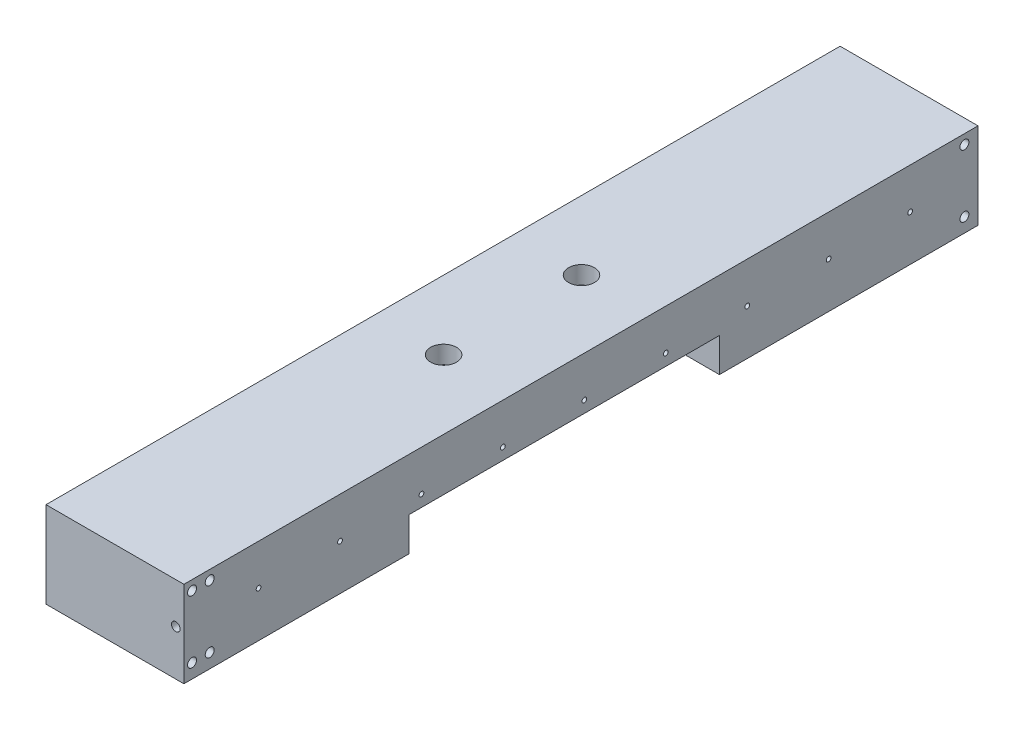
ISO-10303-21;
HEADER;
FILE_DESCRIPTION(('STEP AP214'),'2;1');
FILE_NAME('part.step','',(''),(''),'','','');
FILE_SCHEMA(('AUTOMOTIVE_DESIGN { 1 0 10303 214 1 1 1 1 }'));
ENDSEC;
DATA;
#1=APPLICATION_CONTEXT('core data for automotive mechanical design processes');
#2=APPLICATION_PROTOCOL_DEFINITION('international standard','automotive_design',2000,#1);
#3=PRODUCT_CONTEXT('',#1,'mechanical');
#4=PRODUCT('Part','Part','',(#3));
#5=PRODUCT_RELATED_PRODUCT_CATEGORY('part','',(#4));
#6=PRODUCT_DEFINITION_FORMATION('','',#4);
#7=PRODUCT_DEFINITION_CONTEXT('part definition',#1,'design');
#8=PRODUCT_DEFINITION('design','',#6,#7);
#9=PRODUCT_DEFINITION_SHAPE('','',#8);
#10=(LENGTH_UNIT() NAMED_UNIT(*) SI_UNIT(.MILLI.,.METRE.));
#11=(NAMED_UNIT(*) PLANE_ANGLE_UNIT() SI_UNIT($,.RADIAN.));
#12=(NAMED_UNIT(*) SI_UNIT($,.STERADIAN.) SOLID_ANGLE_UNIT());
#13=UNCERTAINTY_MEASURE_WITH_UNIT(LENGTH_MEASURE(1.E-05),#10,'distance_accuracy_value','');
#14=(GEOMETRIC_REPRESENTATION_CONTEXT(3) GLOBAL_UNCERTAINTY_ASSIGNED_CONTEXT((#13)) GLOBAL_UNIT_ASSIGNED_CONTEXT((#10,
#11,#12)) REPRESENTATION_CONTEXT('',''));
#15=CARTESIAN_POINT('',(0.,0.,0.));
#16=DIRECTION('',(0.,0.,1.));
#17=DIRECTION('',(1.,0.,0.));
#18=AXIS2_PLACEMENT_3D('',#15,#16,#17);
#19=CARTESIAN_POINT('',(50.8000000000003,63.5,241.300000000004));
#20=DIRECTION('',(0.,-1.,0.));
#21=DIRECTION('',(0.,0.,-1.));
#22=AXIS2_PLACEMENT_3D('',#19,#20,#21);
#23=CYLINDRICAL_SURFACE('',#22,4.93435191606192);
#24=CARTESIAN_POINT('',(50.8000000000003,24.9999999999998,241.300000000004));
#25=DIRECTION('',(0.,-1.,0.));
#26=DIRECTION('',(0.,0.,-1.));
#27=AXIS2_PLACEMENT_3D('',#24,#25,#26);
#28=CIRCLE('',#27,4.93435191606192);
#29=CARTESIAN_POINT('',(50.8000000000003,24.9999999999998,236.365648083942));
#30=VERTEX_POINT('',#29);
#31=EDGE_CURVE('E165',#30,#30,#28,.T.);
#32=ORIENTED_EDGE('',*,*,#31,.T.);
#33=EDGE_LOOP('',(#32));
#34=FACE_BOUND('',#33,.T.);
#35=CARTESIAN_POINT('',(50.8000000000003,50.4,241.300000000004));
#36=DIRECTION('',(0.,1.,0.));
#37=DIRECTION('',(0.,0.,1.));
#38=AXIS2_PLACEMENT_3D('',#35,#36,#37);
#39=CIRCLE('',#38,4.93435191606192);
#40=CARTESIAN_POINT('',(50.8000000000003,50.4,246.234351916066));
#41=VERTEX_POINT('',#40);
#42=EDGE_CURVE('E39',#41,#41,#39,.F.);
#43=ORIENTED_EDGE('',*,*,#42,.F.);
#44=EDGE_LOOP('',(#43));
#45=FACE_BOUND('',#44,.T.);
#46=ADVANCED_FACE('F35',(#34,#45),#23,.F.);
#47=CARTESIAN_POINT('',(50.8000000000003,63.5,342.900000000004));
#48=DIRECTION('',(0.,-1.,0.));
#49=DIRECTION('',(0.,0.,-1.));
#50=AXIS2_PLACEMENT_3D('',#47,#48,#49);
#51=CYLINDRICAL_SURFACE('',#50,4.93435191606192);
#52=CARTESIAN_POINT('',(50.8000000000003,24.9999999999998,342.900000000004));
#53=DIRECTION('',(0.,-1.,0.));
#54=DIRECTION('',(0.,0.,-1.));
#55=AXIS2_PLACEMENT_3D('',#52,#53,#54);
#56=CIRCLE('',#55,4.93435191606192);
#57=CARTESIAN_POINT('',(50.8000000000003,24.9999999999998,337.965648083942));
#58=VERTEX_POINT('',#57);
#59=EDGE_CURVE('E174',#58,#58,#56,.T.);
#60=ORIENTED_EDGE('',*,*,#59,.T.);
#61=EDGE_LOOP('',(#60));
#62=FACE_BOUND('',#61,.T.);
#63=CARTESIAN_POINT('',(50.8000000000003,50.4,342.900000000004));
#64=DIRECTION('',(0.,1.,0.));
#65=DIRECTION('',(0.,0.,1.));
#66=AXIS2_PLACEMENT_3D('',#63,#64,#65);
#67=CIRCLE('',#66,4.93435191606192);
#68=CARTESIAN_POINT('',(50.8000000000003,50.4,347.834351916066));
#69=VERTEX_POINT('',#68);
#70=EDGE_CURVE('E135',#69,#69,#67,.F.);
#71=ORIENTED_EDGE('',*,*,#70,.F.);
#72=EDGE_LOOP('',(#71));
#73=FACE_BOUND('',#72,.T.);
#74=ADVANCED_FACE('F330',(#62,#73),#51,.F.);
#75=CARTESIAN_POINT('',(0.,0.,585.0001));
#76=DIRECTION('',(0.,1.,0.));
#77=DIRECTION('',(0.,0.,1.));
#78=AXIS2_PLACEMENT_3D('',#75,#76,#77);
#79=PLANE('',#78);
#80=DIRECTION('',(0.,0.,-1.));
#81=VECTOR('',#80,1.);
#82=CARTESIAN_POINT('',(101.6,0.,585.0001));
#83=LINE('',#82,#81);
#84=CARTESIAN_POINT('',(101.6,0.,190.5));
#85=VERTEX_POINT('',#84);
#86=CARTESIAN_POINT('',(101.6,0.,0.));
#87=VERTEX_POINT('',#86);
#88=EDGE_CURVE('E130',#85,#87,#83,.T.);
#89=ORIENTED_EDGE('',*,*,#88,.F.);
#90=DIRECTION('',(-1.,0.,0.));
#91=VECTOR('',#90,1.);
#92=CARTESIAN_POINT('',(101.6,0.,190.5));
#93=LINE('',#92,#91);
#94=CARTESIAN_POINT('',(0.,0.,190.5));
#95=VERTEX_POINT('',#94);
#96=EDGE_CURVE('E278',#85,#95,#93,.T.);
#97=ORIENTED_EDGE('',*,*,#96,.T.);
#98=DIRECTION('',(0.,0.,-1.));
#99=VECTOR('',#98,1.);
#100=CARTESIAN_POINT('',(0.,0.,585.0001));
#101=LINE('',#100,#99);
#102=CARTESIAN_POINT('',(0.,0.,0.));
#103=VERTEX_POINT('',#102);
#104=EDGE_CURVE('E44',#95,#103,#101,.T.);
#105=ORIENTED_EDGE('',*,*,#104,.T.);
#106=DIRECTION('',(1.,0.,0.));
#107=VECTOR('',#106,1.);
#108=CARTESIAN_POINT('',(0.,0.,0.));
#109=LINE('',#108,#107);
#110=EDGE_CURVE('E293',#103,#87,#109,.T.);
#111=ORIENTED_EDGE('',*,*,#110,.T.);
#112=EDGE_LOOP('',(#89,#97,#105,#111));
#113=FACE_BOUND('',#112,.T.);
#114=ADVANCED_FACE('F311',(#113),#79,.F.);
#115=CARTESIAN_POINT('',(0.,0.,585.0001));
#116=DIRECTION('',(1.,0.,0.));
#117=DIRECTION('',(0.,0.,-1.));
#118=AXIS2_PLACEMENT_3D('',#115,#116,#117);
#119=PLANE('',#118);
#120=CARTESIAN_POINT('',(0.,41.2873800000004,528.383982869842));
#121=DIRECTION('',(-1.,0.,0.));
#122=DIRECTION('',(0.,0.,1.));
#123=AXIS2_PLACEMENT_3D('',#120,#121,#122);
#124=CIRCLE('',#123,3.17499999999999);
#125=CARTESIAN_POINT('',(0.,41.2873800000004,531.558982869842));
#126=VERTEX_POINT('',#125);
#127=EDGE_CURVE('E166',#126,#126,#124,.T.);
#128=ORIENTED_EDGE('',*,*,#127,.F.);
#129=EDGE_LOOP('',(#128));
#130=FACE_BOUND('',#129,.T.);
#131=CARTESIAN_POINT('',(0.,41.2873800000004,50.8022026598416));
#132=DIRECTION('',(-1.,0.,0.));
#133=DIRECTION('',(0.,0.,1.));
#134=AXIS2_PLACEMENT_3D('',#131,#132,#133);
#135=CIRCLE('',#134,3.17499999999999);
#136=CARTESIAN_POINT('',(0.,41.2873800000004,53.9772026598416));
#137=VERTEX_POINT('',#136);
#138=EDGE_CURVE('E159',#137,#137,#135,.T.);
#139=ORIENTED_EDGE('',*,*,#138,.F.);
#140=EDGE_LOOP('',(#139));
#141=FACE_BOUND('',#140,.T.);
#142=ORIENTED_EDGE('',*,*,#104,.F.);
#143=DIRECTION('',(0.,-1.,0.));
#144=VECTOR('',#143,1.);
#145=CARTESIAN_POINT('',(0.,0.,190.5));
#146=LINE('',#145,#144);
#147=CARTESIAN_POINT('',(0.,24.9999999999998,190.5));
#148=VERTEX_POINT('',#147);
#149=EDGE_CURVE('E119',#148,#95,#146,.T.);
#150=ORIENTED_EDGE('',*,*,#149,.F.);
#151=DIRECTION('',(0.,0.,-1.));
#152=VECTOR('',#151,1.);
#153=CARTESIAN_POINT('',(0.,24.9999999999998,190.5));
#154=LINE('',#153,#152);
#155=CARTESIAN_POINT('',(0.,24.9999999999998,419.1));
#156=VERTEX_POINT('',#155);
#157=EDGE_CURVE('E274',#156,#148,#154,.T.);
#158=ORIENTED_EDGE('',*,*,#157,.F.);
#159=DIRECTION('',(0.,1.,0.));
#160=VECTOR('',#159,1.);
#161=CARTESIAN_POINT('',(0.,24.9999999999998,419.1));
#162=LINE('',#161,#160);
#163=CARTESIAN_POINT('',(0.,0.,419.1));
#164=VERTEX_POINT('',#163);
#165=EDGE_CURVE('E219',#164,#156,#162,.T.);
#166=ORIENTED_EDGE('',*,*,#165,.F.);
#167=CARTESIAN_POINT('',(0.,0.,585.0001));
#168=VERTEX_POINT('',#167);
#169=EDGE_CURVE('E11',#168,#164,#101,.T.);
#170=ORIENTED_EDGE('',*,*,#169,.F.);
#171=DIRECTION('',(0.,-1.,0.));
#172=VECTOR('',#171,1.);
#173=CARTESIAN_POINT('',(0.,0.,585.0001));
#174=LINE('',#173,#172);
#175=CARTESIAN_POINT('',(0.,63.5,585.0001));
#176=VERTEX_POINT('',#175);
#177=EDGE_CURVE('E285',#176,#168,#174,.T.);
#178=ORIENTED_EDGE('',*,*,#177,.F.);
#179=DIRECTION('',(0.,0.,-1.));
#180=VECTOR('',#179,1.);
#181=CARTESIAN_POINT('',(0.,63.5,585.0001));
#182=LINE('',#181,#180);
#183=CARTESIAN_POINT('',(0.,63.5,0.));
#184=VERTEX_POINT('',#183);
#185=EDGE_CURVE('E290',#176,#184,#182,.T.);
#186=ORIENTED_EDGE('',*,*,#185,.T.);
#187=DIRECTION('',(0.,-1.,0.));
#188=VECTOR('',#187,1.);
#189=CARTESIAN_POINT('',(0.,0.,0.));
#190=LINE('',#189,#188);
#191=EDGE_CURVE('E281',#184,#103,#190,.T.);
#192=ORIENTED_EDGE('',*,*,#191,.T.);
#193=EDGE_LOOP('',(#142,#150,#158,#166,#170,#178,#186,#192));
#194=FACE_BOUND('',#193,.T.);
#195=ADVANCED_FACE('F37',(#130,#141,#194),#119,.F.);
#196=ORIENTED_EDGE('',*,*,#169,.T.);
#197=DIRECTION('',(-1.,0.,0.));
#198=VECTOR('',#197,1.);
#199=CARTESIAN_POINT('',(101.6,0.,419.1));
#200=LINE('',#199,#198);
#201=CARTESIAN_POINT('',(101.6,0.,419.1));
#202=VERTEX_POINT('',#201);
#203=EDGE_CURVE('E114',#202,#164,#200,.T.);
#204=ORIENTED_EDGE('',*,*,#203,.F.);
#205=CARTESIAN_POINT('',(101.6,0.,585.0001));
#206=VERTEX_POINT('',#205);
#207=EDGE_CURVE('E122',#206,#202,#83,.T.);
#208=ORIENTED_EDGE('',*,*,#207,.F.);
#209=DIRECTION('',(1.,0.,0.));
#210=VECTOR('',#209,1.);
#211=CARTESIAN_POINT('',(0.,0.,585.0001));
#212=LINE('',#211,#210);
#213=EDGE_CURVE('E89',#168,#206,#212,.T.);
#214=ORIENTED_EDGE('',*,*,#213,.F.);
#215=EDGE_LOOP('',(#196,#204,#208,#214));
#216=FACE_BOUND('',#215,.T.);
#217=ADVANCED_FACE('F121',(#216),#79,.F.);
#218=CARTESIAN_POINT('',(101.6,0.,585.0001));
#219=DIRECTION('',(-1.,0.,0.));
#220=DIRECTION('',(0.,0.,1.));
#221=AXIS2_PLACEMENT_3D('',#218,#219,#220);
#222=PLANE('',#221);
#223=CARTESIAN_POINT('',(101.6,10.4999999998737,579.));
#224=DIRECTION('',(-1.,0.,0.));
#225=DIRECTION('',(0.,0.,1.));
#226=AXIS2_PLACEMENT_3D('',#223,#224,#225);
#227=CIRCLE('',#226,3.30000000000003);
#228=CARTESIAN_POINT('',(101.6,10.4999999998737,582.3));
#229=VERTEX_POINT('',#228);
#230=EDGE_CURVE('E190',#229,#229,#227,.T.);
#231=ORIENTED_EDGE('',*,*,#230,.T.);
#232=EDGE_LOOP('',(#231));
#233=FACE_BOUND('',#232,.T.);
#234=CARTESIAN_POINT('',(101.6,56.4999999998737,579.));
#235=DIRECTION('',(-1.,0.,0.));
#236=DIRECTION('',(0.,0.,1.));
#237=AXIS2_PLACEMENT_3D('',#234,#235,#236);
#238=CIRCLE('',#237,3.30000000000003);
#239=CARTESIAN_POINT('',(101.6,56.4999999998737,582.3));
#240=VERTEX_POINT('',#239);
#241=EDGE_CURVE('E196',#240,#240,#238,.T.);
#242=ORIENTED_EDGE('',*,*,#241,.T.);
#243=EDGE_LOOP('',(#242));
#244=FACE_BOUND('',#243,.T.);
#245=CARTESIAN_POINT('',(101.6,56.4999999998737,566.));
#246=DIRECTION('',(-1.,0.,0.));
#247=DIRECTION('',(0.,0.,1.));
#248=AXIS2_PLACEMENT_3D('',#245,#246,#247);
#249=CIRCLE('',#248,3.30000000000003);
#250=CARTESIAN_POINT('',(101.6,56.4999999998737,569.3));
#251=VERTEX_POINT('',#250);
#252=EDGE_CURVE('E202',#251,#251,#249,.T.);
#253=ORIENTED_EDGE('',*,*,#252,.T.);
#254=EDGE_LOOP('',(#253));
#255=FACE_BOUND('',#254,.T.);
#256=CARTESIAN_POINT('',(101.6,10.4999999998737,10.));
#257=DIRECTION('',(-1.,0.,0.));
#258=DIRECTION('',(0.,0.,1.));
#259=AXIS2_PLACEMENT_3D('',#256,#257,#258);
#260=CIRCLE('',#259,3.3);
#261=CARTESIAN_POINT('',(101.6,10.4999999998737,13.3));
#262=VERTEX_POINT('',#261);
#263=EDGE_CURVE('E183',#262,#262,#260,.T.);
#264=ORIENTED_EDGE('',*,*,#263,.T.);
#265=EDGE_LOOP('',(#264));
#266=FACE_BOUND('',#265,.T.);
#267=CARTESIAN_POINT('',(101.6,56.4999999998737,10.));
#268=DIRECTION('',(-1.,0.,0.));
#269=DIRECTION('',(0.,0.,1.));
#270=AXIS2_PLACEMENT_3D('',#267,#268,#269);
#271=CIRCLE('',#270,3.3);
#272=CARTESIAN_POINT('',(101.6,56.4999999998737,13.3));
#273=VERTEX_POINT('',#272);
#274=EDGE_CURVE('E177',#273,#273,#271,.T.);
#275=ORIENTED_EDGE('',*,*,#274,.T.);
#276=EDGE_LOOP('',(#275));
#277=FACE_BOUND('',#276,.T.);
#278=CARTESIAN_POINT('',(101.6,10.4999999998737,566.));
#279=DIRECTION('',(-1.,0.,0.));
#280=DIRECTION('',(0.,0.,1.));
#281=AXIS2_PLACEMENT_3D('',#278,#279,#280);
#282=CIRCLE('',#281,3.30000000000003);
#283=CARTESIAN_POINT('',(101.6,10.4999999998737,569.3));
#284=VERTEX_POINT('',#283);
#285=EDGE_CURVE('E189',#284,#284,#282,.T.);
#286=ORIENTED_EDGE('',*,*,#285,.T.);
#287=EDGE_LOOP('',(#286));
#288=FACE_BOUND('',#287,.T.);
#289=CARTESIAN_POINT('',(101.6,33.4999999999998,530.000000000004));
#290=DIRECTION('',(-1.,0.,0.));
#291=DIRECTION('',(0.,0.,1.));
#292=AXIS2_PLACEMENT_3D('',#289,#290,#291);
#293=CIRCLE('',#292,1.75);
#294=CARTESIAN_POINT('',(101.6,33.4999999999998,531.750000000004));
#295=VERTEX_POINT('',#294);
#296=EDGE_CURVE('E220',#295,#295,#293,.T.);
#297=ORIENTED_EDGE('',*,*,#296,.T.);
#298=EDGE_LOOP('',(#297));
#299=FACE_BOUND('',#298,.T.);
#300=CARTESIAN_POINT('',(101.6,33.4999999999998,470.000000000004));
#301=DIRECTION('',(-1.,0.,0.));
#302=DIRECTION('',(0.,0.,1.));
#303=AXIS2_PLACEMENT_3D('',#300,#301,#302);
#304=CIRCLE('',#303,1.75);
#305=CARTESIAN_POINT('',(101.6,33.4999999999998,471.750000000004));
#306=VERTEX_POINT('',#305);
#307=EDGE_CURVE('E223',#306,#306,#304,.T.);
#308=ORIENTED_EDGE('',*,*,#307,.T.);
#309=EDGE_LOOP('',(#308));
#310=FACE_BOUND('',#309,.T.);
#311=CARTESIAN_POINT('',(101.6,33.4999999999998,410.000000000004));
#312=DIRECTION('',(-1.,0.,0.));
#313=DIRECTION('',(0.,0.,1.));
#314=AXIS2_PLACEMENT_3D('',#311,#312,#313);
#315=CIRCLE('',#314,1.75);
#316=CARTESIAN_POINT('',(101.6,33.4999999999998,411.750000000004));
#317=VERTEX_POINT('',#316);
#318=EDGE_CURVE('E229',#317,#317,#315,.T.);
#319=ORIENTED_EDGE('',*,*,#318,.T.);
#320=EDGE_LOOP('',(#319));
#321=FACE_BOUND('',#320,.T.);
#322=CARTESIAN_POINT('',(101.6,33.4999999999998,350.000000000004));
#323=DIRECTION('',(-1.,0.,0.));
#324=DIRECTION('',(0.,0.,1.));
#325=AXIS2_PLACEMENT_3D('',#322,#323,#324);
#326=CIRCLE('',#325,1.75);
#327=CARTESIAN_POINT('',(101.6,33.4999999999998,351.750000000004));
#328=VERTEX_POINT('',#327);
#329=EDGE_CURVE('E235',#328,#328,#326,.T.);
#330=ORIENTED_EDGE('',*,*,#329,.T.);
#331=EDGE_LOOP('',(#330));
#332=FACE_BOUND('',#331,.T.);
#333=CARTESIAN_POINT('',(101.6,33.4999999999998,290.000000000004));
#334=DIRECTION('',(-1.,0.,0.));
#335=DIRECTION('',(0.,0.,1.));
#336=AXIS2_PLACEMENT_3D('',#333,#334,#335);
#337=CIRCLE('',#336,1.75);
#338=CARTESIAN_POINT('',(101.6,33.4999999999998,291.750000000004));
#339=VERTEX_POINT('',#338);
#340=EDGE_CURVE('E241',#339,#339,#337,.T.);
#341=ORIENTED_EDGE('',*,*,#340,.T.);
#342=EDGE_LOOP('',(#341));
#343=FACE_BOUND('',#342,.T.);
#344=CARTESIAN_POINT('',(101.6,33.4999999999998,230.000000000004));
#345=DIRECTION('',(-1.,0.,0.));
#346=DIRECTION('',(0.,0.,1.));
#347=AXIS2_PLACEMENT_3D('',#344,#345,#346);
#348=CIRCLE('',#347,1.75);
#349=CARTESIAN_POINT('',(101.6,33.4999999999998,231.750000000004));
#350=VERTEX_POINT('',#349);
#351=EDGE_CURVE('E247',#350,#350,#348,.T.);
#352=ORIENTED_EDGE('',*,*,#351,.T.);
#353=EDGE_LOOP('',(#352));
#354=FACE_BOUND('',#353,.T.);
#355=CARTESIAN_POINT('',(101.6,33.4999999999998,170.000000000004));
#356=DIRECTION('',(-1.,0.,0.));
#357=DIRECTION('',(0.,0.,1.));
#358=AXIS2_PLACEMENT_3D('',#355,#356,#357);
#359=CIRCLE('',#358,1.75);
#360=CARTESIAN_POINT('',(101.6,33.4999999999998,171.750000000004));
#361=VERTEX_POINT('',#360);
#362=EDGE_CURVE('E253',#361,#361,#359,.T.);
#363=ORIENTED_EDGE('',*,*,#362,.T.);
#364=EDGE_LOOP('',(#363));
#365=FACE_BOUND('',#364,.T.);
#366=CARTESIAN_POINT('',(101.6,33.4999999999998,110.000000000004));
#367=DIRECTION('',(-1.,0.,0.));
#368=DIRECTION('',(0.,0.,1.));
#369=AXIS2_PLACEMENT_3D('',#366,#367,#368);
#370=CIRCLE('',#369,1.75);
#371=CARTESIAN_POINT('',(101.6,33.4999999999998,111.750000000004));
#372=VERTEX_POINT('',#371);
#373=EDGE_CURVE('E259',#372,#372,#370,.T.);
#374=ORIENTED_EDGE('',*,*,#373,.T.);
#375=EDGE_LOOP('',(#374));
#376=FACE_BOUND('',#375,.T.);
#377=CARTESIAN_POINT('',(101.6,33.4999999999998,50.0000000000041));
#378=DIRECTION('',(-1.,0.,0.));
#379=DIRECTION('',(0.,0.,1.));
#380=AXIS2_PLACEMENT_3D('',#377,#378,#379);
#381=CIRCLE('',#380,1.75);
#382=CARTESIAN_POINT('',(101.6,33.4999999999998,51.7500000000042));
#383=VERTEX_POINT('',#382);
#384=EDGE_CURVE('E265',#383,#383,#381,.T.);
#385=ORIENTED_EDGE('',*,*,#384,.T.);
#386=EDGE_LOOP('',(#385));
#387=FACE_BOUND('',#386,.T.);
#388=DIRECTION('',(0.,0.,-1.));
#389=VECTOR('',#388,1.);
#390=CARTESIAN_POINT('',(101.6,24.9999999999998,190.5));
#391=LINE('',#390,#389);
#392=CARTESIAN_POINT('',(101.6,24.9999999999998,419.1));
#393=VERTEX_POINT('',#392);
#394=CARTESIAN_POINT('',(101.6,24.9999999999998,190.5));
#395=VERTEX_POINT('',#394);
#396=EDGE_CURVE('E52',#393,#395,#391,.T.);
#397=ORIENTED_EDGE('',*,*,#396,.T.);
#398=DIRECTION('',(0.,-1.,0.));
#399=VECTOR('',#398,1.);
#400=CARTESIAN_POINT('',(101.6,0.,190.5));
#401=LINE('',#400,#399);
#402=EDGE_CURVE('E125',#395,#85,#401,.T.);
#403=ORIENTED_EDGE('',*,*,#402,.T.);
#404=ORIENTED_EDGE('',*,*,#88,.T.);
#405=DIRECTION('',(0.,1.,0.));
#406=VECTOR('',#405,1.);
#407=CARTESIAN_POINT('',(101.6,0.,0.));
#408=LINE('',#407,#406);
#409=CARTESIAN_POINT('',(101.6,63.5,0.));
#410=VERTEX_POINT('',#409);
#411=EDGE_CURVE('E296',#87,#410,#408,.T.);
#412=ORIENTED_EDGE('',*,*,#411,.T.);
#413=DIRECTION('',(0.,0.,-1.));
#414=VECTOR('',#413,1.);
#415=CARTESIAN_POINT('',(101.6,63.5,585.0001));
#416=LINE('',#415,#414);
#417=CARTESIAN_POINT('',(101.6,63.5,585.0001));
#418=VERTEX_POINT('',#417);
#419=EDGE_CURVE('E132',#418,#410,#416,.T.);
#420=ORIENTED_EDGE('',*,*,#419,.F.);
#421=DIRECTION('',(0.,1.,0.));
#422=VECTOR('',#421,1.);
#423=CARTESIAN_POINT('',(101.6,0.,585.0001));
#424=LINE('',#423,#422);
#425=EDGE_CURVE('E129',#206,#418,#424,.T.);
#426=ORIENTED_EDGE('',*,*,#425,.F.);
#427=ORIENTED_EDGE('',*,*,#207,.T.);
#428=DIRECTION('',(0.,1.,0.));
#429=VECTOR('',#428,1.);
#430=CARTESIAN_POINT('',(101.6,24.9999999999998,419.1));
#431=LINE('',#430,#429);
#432=EDGE_CURVE('E110',#202,#393,#431,.T.);
#433=ORIENTED_EDGE('',*,*,#432,.T.);
#434=EDGE_LOOP('',(#397,#403,#404,#412,#420,#426,#427,#433));
#435=FACE_BOUND('',#434,.T.);
#436=ADVANCED_FACE('F127',(#233,#244,#255,#266,#277,#288,#299,#310,#321,#332,#343,#354,#365,
#376,#387,#435),#222,.F.);
#437=CARTESIAN_POINT('',(0.,63.5,585.0001));
#438=DIRECTION('',(0.,-1.,0.));
#439=DIRECTION('',(0.,0.,-1.));
#440=AXIS2_PLACEMENT_3D('',#437,#438,#439);
#441=PLANE('',#440);
#442=CARTESIAN_POINT('',(50.8,63.5,342.9));
#443=DIRECTION('',(0.,1.,0.));
#444=DIRECTION('',(0.,0.,1.));
#445=AXIS2_PLACEMENT_3D('',#442,#443,#444);
#446=CIRCLE('',#445,9.525);
#447=CARTESIAN_POINT('',(50.8,63.5,352.425));
#448=VERTEX_POINT('',#447);
#449=EDGE_CURVE('E137',#448,#448,#446,.T.);
#450=ORIENTED_EDGE('',*,*,#449,.F.);
#451=EDGE_LOOP('',(#450));
#452=FACE_BOUND('',#451,.T.);
#453=CARTESIAN_POINT('',(50.8000000000003,63.5000000000001,241.300000000004));
#454=DIRECTION('',(0.,1.,0.));
#455=DIRECTION('',(0.,0.,1.));
#456=AXIS2_PLACEMENT_3D('',#453,#454,#455);
#457=CIRCLE('',#456,9.525);
#458=CARTESIAN_POINT('',(50.8000000000003,63.5000000000001,250.825000000004));
#459=VERTEX_POINT('',#458);
#460=EDGE_CURVE('E148',#459,#459,#457,.T.);
#461=ORIENTED_EDGE('',*,*,#460,.F.);
#462=EDGE_LOOP('',(#461));
#463=FACE_BOUND('',#462,.T.);
#464=DIRECTION('',(-1.,0.,0.));
#465=VECTOR('',#464,1.);
#466=CARTESIAN_POINT('',(0.,63.5,0.));
#467=LINE('',#466,#465);
#468=EDGE_CURVE('E82',#410,#184,#467,.T.);
#469=ORIENTED_EDGE('',*,*,#468,.T.);
#470=ORIENTED_EDGE('',*,*,#185,.F.);
#471=DIRECTION('',(-1.,0.,0.));
#472=VECTOR('',#471,1.);
#473=CARTESIAN_POINT('',(0.,63.5,585.0001));
#474=LINE('',#473,#472);
#475=EDGE_CURVE('E61',#418,#176,#474,.T.);
#476=ORIENTED_EDGE('',*,*,#475,.F.);
#477=ORIENTED_EDGE('',*,*,#419,.T.);
#478=EDGE_LOOP('',(#469,#470,#476,#477));
#479=FACE_BOUND('',#478,.T.);
#480=ADVANCED_FACE('F301',(#452,#463,#479),#441,.F.);
#481=CARTESIAN_POINT('',(0.,0.,585.0001));
#482=DIRECTION('',(0.,0.,-1.));
#483=DIRECTION('',(-1.,0.,0.));
#484=AXIS2_PLACEMENT_3D('',#481,#482,#483);
#485=PLANE('',#484);
#486=CARTESIAN_POINT('',(95.6499999999998,33.5,585.0001));
#487=DIRECTION('',(0.,0.,1.));
#488=DIRECTION('',(1.,0.,0.));
#489=AXIS2_PLACEMENT_3D('',#486,#487,#488);
#490=CIRCLE('',#489,3.17500000000023);
#491=CARTESIAN_POINT('',(98.825,33.5,585.0001));
#492=VERTEX_POINT('',#491);
#493=EDGE_CURVE('E141',#492,#492,#490,.T.);
#494=ORIENTED_EDGE('',*,*,#493,.F.);
#495=EDGE_LOOP('',(#494));
#496=FACE_BOUND('',#495,.T.);
#497=ORIENTED_EDGE('',*,*,#177,.T.);
#498=ORIENTED_EDGE('',*,*,#213,.T.);
#499=ORIENTED_EDGE('',*,*,#425,.T.);
#500=ORIENTED_EDGE('',*,*,#475,.T.);
#501=EDGE_LOOP('',(#497,#498,#499,#500));
#502=FACE_BOUND('',#501,.T.);
#503=ADVANCED_FACE('F316',(#496,#502),#485,.F.);
#504=CARTESIAN_POINT('',(0.,0.,0.));
#505=DIRECTION('',(0.,0.,-1.));
#506=DIRECTION('',(-1.,0.,0.));
#507=AXIS2_PLACEMENT_3D('',#504,#505,#506);
#508=PLANE('',#507);
#509=ORIENTED_EDGE('',*,*,#191,.F.);
#510=ORIENTED_EDGE('',*,*,#468,.F.);
#511=ORIENTED_EDGE('',*,*,#411,.F.);
#512=ORIENTED_EDGE('',*,*,#110,.F.);
#513=EDGE_LOOP('',(#509,#510,#511,#512));
#514=FACE_BOUND('',#513,.T.);
#515=ADVANCED_FACE('F304',(#514),#508,.T.);
#516=CARTESIAN_POINT('',(101.6,0.,190.5));
#517=DIRECTION('',(0.,0.,-1.));
#518=DIRECTION('',(-1.,0.,0.));
#519=AXIS2_PLACEMENT_3D('',#516,#517,#518);
#520=PLANE('',#519);
#521=ORIENTED_EDGE('',*,*,#149,.T.);
#522=ORIENTED_EDGE('',*,*,#96,.F.);
#523=ORIENTED_EDGE('',*,*,#402,.F.);
#524=DIRECTION('',(-1.,0.,0.));
#525=VECTOR('',#524,1.);
#526=CARTESIAN_POINT('',(101.6,24.9999999999998,190.5));
#527=LINE('',#526,#525);
#528=EDGE_CURVE('E282',#395,#148,#527,.T.);
#529=ORIENTED_EDGE('',*,*,#528,.T.);
#530=EDGE_LOOP('',(#521,#522,#523,#529));
#531=FACE_BOUND('',#530,.T.);
#532=ADVANCED_FACE('F314',(#531),#520,.F.);
#533=CARTESIAN_POINT('',(101.6,24.9999999999998,190.5));
#534=DIRECTION('',(0.,1.,0.));
#535=DIRECTION('',(0.,0.,1.));
#536=AXIS2_PLACEMENT_3D('',#533,#534,#535);
#537=PLANE('',#536);
#538=ORIENTED_EDGE('',*,*,#59,.F.);
#539=EDGE_LOOP('',(#538));
#540=FACE_BOUND('',#539,.T.);
#541=ORIENTED_EDGE('',*,*,#31,.F.);
#542=EDGE_LOOP('',(#541));
#543=FACE_BOUND('',#542,.T.);
#544=ORIENTED_EDGE('',*,*,#157,.T.);
#545=ORIENTED_EDGE('',*,*,#528,.F.);
#546=ORIENTED_EDGE('',*,*,#396,.F.);
#547=DIRECTION('',(-1.,0.,0.));
#548=VECTOR('',#547,1.);
#549=CARTESIAN_POINT('',(101.6,24.9999999999998,419.1));
#550=LINE('',#549,#548);
#551=EDGE_CURVE('E116',#393,#156,#550,.T.);
#552=ORIENTED_EDGE('',*,*,#551,.T.);
#553=EDGE_LOOP('',(#544,#545,#546,#552));
#554=FACE_BOUND('',#553,.T.);
#555=ADVANCED_FACE('F315',(#540,#543,#554),#537,.F.);
#556=CARTESIAN_POINT('',(101.6,24.9999999999998,419.1));
#557=DIRECTION('',(0.,0.,1.));
#558=DIRECTION('',(1.,0.,0.));
#559=AXIS2_PLACEMENT_3D('',#556,#557,#558);
#560=PLANE('',#559);
#561=ORIENTED_EDGE('',*,*,#165,.T.);
#562=ORIENTED_EDGE('',*,*,#551,.F.);
#563=ORIENTED_EDGE('',*,*,#432,.F.);
#564=ORIENTED_EDGE('',*,*,#203,.T.);
#565=EDGE_LOOP('',(#561,#562,#563,#564));
#566=FACE_BOUND('',#565,.T.);
#567=ADVANCED_FACE('F113',(#566),#560,.F.);
#568=CARTESIAN_POINT('',(95.25,33.4999999999998,50.0000000000041));
#569=DIRECTION('',(1.,0.,0.));
#570=DIRECTION('',(0.,0.,-1.));
#571=AXIS2_PLACEMENT_3D('',#568,#569,#570);
#572=CYLINDRICAL_SURFACE('',#571,1.75);
#573=ORIENTED_EDGE('',*,*,#384,.F.);
#574=EDGE_LOOP('',(#573));
#575=FACE_BOUND('',#574,.T.);
#576=CARTESIAN_POINT('',(95.25,33.4999999999998,50.0000000000041));
#577=DIRECTION('',(-1.,0.,0.));
#578=DIRECTION('',(0.,0.,1.));
#579=AXIS2_PLACEMENT_3D('',#576,#577,#578);
#580=CIRCLE('',#579,1.75);
#581=CARTESIAN_POINT('',(95.25,33.4999999999998,51.7500000000042));
#582=VERTEX_POINT('',#581);
#583=EDGE_CURVE('E213',#582,#582,#580,.T.);
#584=ORIENTED_EDGE('',*,*,#583,.T.);
#585=EDGE_LOOP('',(#584));
#586=FACE_BOUND('',#585,.T.);
#587=ADVANCED_FACE('F455',(#575,#586),#572,.F.);
#588=CARTESIAN_POINT('',(95.25,33.4999999999998,50.0000000000041));
#589=DIRECTION('',(-1.,0.,0.));
#590=DIRECTION('',(0.,0.,1.));
#591=AXIS2_PLACEMENT_3D('',#588,#589,#590);
#592=PLANE('',#591);
#593=ORIENTED_EDGE('',*,*,#583,.F.);
#594=EDGE_LOOP('',(#593));
#595=FACE_BOUND('',#594,.T.);
#596=ADVANCED_FACE('F450',(#595),#592,.F.);
#597=CARTESIAN_POINT('',(95.25,33.4999999999998,110.000000000004));
#598=DIRECTION('',(1.,0.,0.));
#599=DIRECTION('',(0.,0.,-1.));
#600=AXIS2_PLACEMENT_3D('',#597,#598,#599);
#601=CYLINDRICAL_SURFACE('',#600,1.75);
#602=ORIENTED_EDGE('',*,*,#373,.F.);
#603=EDGE_LOOP('',(#602));
#604=FACE_BOUND('',#603,.T.);
#605=CARTESIAN_POINT('',(95.25,33.4999999999998,110.000000000004));
#606=DIRECTION('',(-1.,0.,0.));
#607=DIRECTION('',(0.,0.,1.));
#608=AXIS2_PLACEMENT_3D('',#605,#606,#607);
#609=CIRCLE('',#608,1.75);
#610=CARTESIAN_POINT('',(95.25,33.4999999999998,111.750000000004));
#611=VERTEX_POINT('',#610);
#612=EDGE_CURVE('E262',#611,#611,#609,.T.);
#613=ORIENTED_EDGE('',*,*,#612,.T.);
#614=EDGE_LOOP('',(#613));
#615=FACE_BOUND('',#614,.T.);
#616=ADVANCED_FACE('F447',(#604,#615),#601,.F.);
#617=CARTESIAN_POINT('',(95.25,33.4999999999998,110.000000000004));
#618=DIRECTION('',(-1.,0.,0.));
#619=DIRECTION('',(0.,0.,1.));
#620=AXIS2_PLACEMENT_3D('',#617,#618,#619);
#621=PLANE('',#620);
#622=ORIENTED_EDGE('',*,*,#612,.F.);
#623=EDGE_LOOP('',(#622));
#624=FACE_BOUND('',#623,.T.);
#625=ADVANCED_FACE('F442',(#624),#621,.F.);
#626=CARTESIAN_POINT('',(95.25,33.4999999999998,170.000000000004));
#627=DIRECTION('',(1.,0.,0.));
#628=DIRECTION('',(0.,0.,-1.));
#629=AXIS2_PLACEMENT_3D('',#626,#627,#628);
#630=CYLINDRICAL_SURFACE('',#629,1.75);
#631=ORIENTED_EDGE('',*,*,#362,.F.);
#632=EDGE_LOOP('',(#631));
#633=FACE_BOUND('',#632,.T.);
#634=CARTESIAN_POINT('',(95.25,33.4999999999998,170.000000000004));
#635=DIRECTION('',(-1.,0.,0.));
#636=DIRECTION('',(0.,0.,1.));
#637=AXIS2_PLACEMENT_3D('',#634,#635,#636);
#638=CIRCLE('',#637,1.75);
#639=CARTESIAN_POINT('',(95.25,33.4999999999998,171.750000000004));
#640=VERTEX_POINT('',#639);
#641=EDGE_CURVE('E256',#640,#640,#638,.T.);
#642=ORIENTED_EDGE('',*,*,#641,.T.);
#643=EDGE_LOOP('',(#642));
#644=FACE_BOUND('',#643,.T.);
#645=ADVANCED_FACE('F439',(#633,#644),#630,.F.);
#646=CARTESIAN_POINT('',(95.25,33.4999999999998,170.000000000004));
#647=DIRECTION('',(-1.,0.,0.));
#648=DIRECTION('',(0.,0.,1.));
#649=AXIS2_PLACEMENT_3D('',#646,#647,#648);
#650=PLANE('',#649);
#651=ORIENTED_EDGE('',*,*,#641,.F.);
#652=EDGE_LOOP('',(#651));
#653=FACE_BOUND('',#652,.T.);
#654=ADVANCED_FACE('F434',(#653),#650,.F.);
#655=CARTESIAN_POINT('',(95.25,33.4999999999998,230.000000000004));
#656=DIRECTION('',(1.,0.,0.));
#657=DIRECTION('',(0.,0.,-1.));
#658=AXIS2_PLACEMENT_3D('',#655,#656,#657);
#659=CYLINDRICAL_SURFACE('',#658,1.75);
#660=ORIENTED_EDGE('',*,*,#351,.F.);
#661=EDGE_LOOP('',(#660));
#662=FACE_BOUND('',#661,.T.);
#663=CARTESIAN_POINT('',(95.25,33.4999999999998,230.000000000004));
#664=DIRECTION('',(-1.,0.,0.));
#665=DIRECTION('',(0.,0.,1.));
#666=AXIS2_PLACEMENT_3D('',#663,#664,#665);
#667=CIRCLE('',#666,1.75);
#668=CARTESIAN_POINT('',(95.25,33.4999999999998,231.750000000004));
#669=VERTEX_POINT('',#668);
#670=EDGE_CURVE('E250',#669,#669,#667,.T.);
#671=ORIENTED_EDGE('',*,*,#670,.T.);
#672=EDGE_LOOP('',(#671));
#673=FACE_BOUND('',#672,.T.);
#674=ADVANCED_FACE('F431',(#662,#673),#659,.F.);
#675=CARTESIAN_POINT('',(95.25,33.4999999999998,230.000000000004));
#676=DIRECTION('',(-1.,0.,0.));
#677=DIRECTION('',(0.,0.,1.));
#678=AXIS2_PLACEMENT_3D('',#675,#676,#677);
#679=PLANE('',#678);
#680=ORIENTED_EDGE('',*,*,#670,.F.);
#681=EDGE_LOOP('',(#680));
#682=FACE_BOUND('',#681,.T.);
#683=ADVANCED_FACE('F426',(#682),#679,.F.);
#684=CARTESIAN_POINT('',(95.25,33.4999999999998,290.000000000004));
#685=DIRECTION('',(1.,0.,0.));
#686=DIRECTION('',(0.,0.,-1.));
#687=AXIS2_PLACEMENT_3D('',#684,#685,#686);
#688=CYLINDRICAL_SURFACE('',#687,1.75);
#689=ORIENTED_EDGE('',*,*,#340,.F.);
#690=EDGE_LOOP('',(#689));
#691=FACE_BOUND('',#690,.T.);
#692=CARTESIAN_POINT('',(95.25,33.4999999999998,290.000000000004));
#693=DIRECTION('',(-1.,0.,0.));
#694=DIRECTION('',(0.,0.,1.));
#695=AXIS2_PLACEMENT_3D('',#692,#693,#694);
#696=CIRCLE('',#695,1.75);
#697=CARTESIAN_POINT('',(95.25,33.4999999999998,291.750000000004));
#698=VERTEX_POINT('',#697);
#699=EDGE_CURVE('E244',#698,#698,#696,.T.);
#700=ORIENTED_EDGE('',*,*,#699,.T.);
#701=EDGE_LOOP('',(#700));
#702=FACE_BOUND('',#701,.T.);
#703=ADVANCED_FACE('F423',(#691,#702),#688,.F.);
#704=CARTESIAN_POINT('',(95.25,33.4999999999998,290.000000000004));
#705=DIRECTION('',(-1.,0.,0.));
#706=DIRECTION('',(0.,0.,1.));
#707=AXIS2_PLACEMENT_3D('',#704,#705,#706);
#708=PLANE('',#707);
#709=ORIENTED_EDGE('',*,*,#699,.F.);
#710=EDGE_LOOP('',(#709));
#711=FACE_BOUND('',#710,.T.);
#712=ADVANCED_FACE('F418',(#711),#708,.F.);
#713=CARTESIAN_POINT('',(95.25,33.4999999999998,350.000000000004));
#714=DIRECTION('',(1.,0.,0.));
#715=DIRECTION('',(0.,0.,-1.));
#716=AXIS2_PLACEMENT_3D('',#713,#714,#715);
#717=CYLINDRICAL_SURFACE('',#716,1.75);
#718=ORIENTED_EDGE('',*,*,#329,.F.);
#719=EDGE_LOOP('',(#718));
#720=FACE_BOUND('',#719,.T.);
#721=CARTESIAN_POINT('',(95.25,33.4999999999998,350.000000000004));
#722=DIRECTION('',(-1.,0.,0.));
#723=DIRECTION('',(0.,0.,1.));
#724=AXIS2_PLACEMENT_3D('',#721,#722,#723);
#725=CIRCLE('',#724,1.75);
#726=CARTESIAN_POINT('',(95.25,33.4999999999998,351.750000000004));
#727=VERTEX_POINT('',#726);
#728=EDGE_CURVE('E238',#727,#727,#725,.T.);
#729=ORIENTED_EDGE('',*,*,#728,.T.);
#730=EDGE_LOOP('',(#729));
#731=FACE_BOUND('',#730,.T.);
#732=ADVANCED_FACE('F415',(#720,#731),#717,.F.);
#733=CARTESIAN_POINT('',(95.25,33.4999999999998,350.000000000004));
#734=DIRECTION('',(-1.,0.,0.));
#735=DIRECTION('',(0.,0.,1.));
#736=AXIS2_PLACEMENT_3D('',#733,#734,#735);
#737=PLANE('',#736);
#738=ORIENTED_EDGE('',*,*,#728,.F.);
#739=EDGE_LOOP('',(#738));
#740=FACE_BOUND('',#739,.T.);
#741=ADVANCED_FACE('F410',(#740),#737,.F.);
#742=CARTESIAN_POINT('',(95.25,33.4999999999998,410.000000000004));
#743=DIRECTION('',(1.,0.,0.));
#744=DIRECTION('',(0.,0.,-1.));
#745=AXIS2_PLACEMENT_3D('',#742,#743,#744);
#746=CYLINDRICAL_SURFACE('',#745,1.75);
#747=ORIENTED_EDGE('',*,*,#318,.F.);
#748=EDGE_LOOP('',(#747));
#749=FACE_BOUND('',#748,.T.);
#750=CARTESIAN_POINT('',(95.25,33.4999999999998,410.000000000004));
#751=DIRECTION('',(-1.,0.,0.));
#752=DIRECTION('',(0.,0.,1.));
#753=AXIS2_PLACEMENT_3D('',#750,#751,#752);
#754=CIRCLE('',#753,1.75);
#755=CARTESIAN_POINT('',(95.25,33.4999999999998,411.750000000004));
#756=VERTEX_POINT('',#755);
#757=EDGE_CURVE('E232',#756,#756,#754,.T.);
#758=ORIENTED_EDGE('',*,*,#757,.T.);
#759=EDGE_LOOP('',(#758));
#760=FACE_BOUND('',#759,.T.);
#761=ADVANCED_FACE('F407',(#749,#760),#746,.F.);
#762=CARTESIAN_POINT('',(95.25,33.4999999999998,410.000000000004));
#763=DIRECTION('',(-1.,0.,0.));
#764=DIRECTION('',(0.,0.,1.));
#765=AXIS2_PLACEMENT_3D('',#762,#763,#764);
#766=PLANE('',#765);
#767=ORIENTED_EDGE('',*,*,#757,.F.);
#768=EDGE_LOOP('',(#767));
#769=FACE_BOUND('',#768,.T.);
#770=ADVANCED_FACE('F402',(#769),#766,.F.);
#771=CARTESIAN_POINT('',(95.25,33.4999999999998,470.000000000004));
#772=DIRECTION('',(1.,0.,0.));
#773=DIRECTION('',(0.,0.,-1.));
#774=AXIS2_PLACEMENT_3D('',#771,#772,#773);
#775=CYLINDRICAL_SURFACE('',#774,1.75);
#776=ORIENTED_EDGE('',*,*,#307,.F.);
#777=EDGE_LOOP('',(#776));
#778=FACE_BOUND('',#777,.T.);
#779=CARTESIAN_POINT('',(95.25,33.4999999999998,470.000000000004));
#780=DIRECTION('',(-1.,0.,0.));
#781=DIRECTION('',(0.,0.,1.));
#782=AXIS2_PLACEMENT_3D('',#779,#780,#781);
#783=CIRCLE('',#782,1.75);
#784=CARTESIAN_POINT('',(95.25,33.4999999999998,471.750000000004));
#785=VERTEX_POINT('',#784);
#786=EDGE_CURVE('E226',#785,#785,#783,.T.);
#787=ORIENTED_EDGE('',*,*,#786,.T.);
#788=EDGE_LOOP('',(#787));
#789=FACE_BOUND('',#788,.T.);
#790=ADVANCED_FACE('F399',(#778,#789),#775,.F.);
#791=CARTESIAN_POINT('',(95.25,33.4999999999998,470.000000000004));
#792=DIRECTION('',(-1.,0.,0.));
#793=DIRECTION('',(0.,0.,1.));
#794=AXIS2_PLACEMENT_3D('',#791,#792,#793);
#795=PLANE('',#794);
#796=ORIENTED_EDGE('',*,*,#786,.F.);
#797=EDGE_LOOP('',(#796));
#798=FACE_BOUND('',#797,.T.);
#799=ADVANCED_FACE('F397',(#798),#795,.F.);
#800=CARTESIAN_POINT('',(95.25,33.4999999999998,530.000000000004));
#801=DIRECTION('',(1.,0.,0.));
#802=DIRECTION('',(0.,0.,-1.));
#803=AXIS2_PLACEMENT_3D('',#800,#801,#802);
#804=CYLINDRICAL_SURFACE('',#803,1.75);
#805=ORIENTED_EDGE('',*,*,#296,.F.);
#806=EDGE_LOOP('',(#805));
#807=FACE_BOUND('',#806,.T.);
#808=CARTESIAN_POINT('',(95.25,33.4999999999998,530.000000000004));
#809=DIRECTION('',(-1.,0.,0.));
#810=DIRECTION('',(0.,0.,1.));
#811=AXIS2_PLACEMENT_3D('',#808,#809,#810);
#812=CIRCLE('',#811,1.75);
#813=CARTESIAN_POINT('',(95.25,33.4999999999998,531.750000000004));
#814=VERTEX_POINT('',#813);
#815=EDGE_CURVE('E216',#814,#814,#812,.T.);
#816=ORIENTED_EDGE('',*,*,#815,.T.);
#817=EDGE_LOOP('',(#816));
#818=FACE_BOUND('',#817,.T.);
#819=ADVANCED_FACE('F393',(#807,#818),#804,.F.);
#820=CARTESIAN_POINT('',(95.25,33.4999999999998,530.000000000004));
#821=DIRECTION('',(-1.,0.,0.));
#822=DIRECTION('',(0.,0.,1.));
#823=AXIS2_PLACEMENT_3D('',#820,#821,#822);
#824=PLANE('',#823);
#825=ORIENTED_EDGE('',*,*,#815,.F.);
#826=EDGE_LOOP('',(#825));
#827=FACE_BOUND('',#826,.T.);
#828=ADVANCED_FACE('F389',(#827),#824,.F.);
#829=CARTESIAN_POINT('',(76.2,10.4999999998737,566.));
#830=DIRECTION('',(1.,0.,0.));
#831=DIRECTION('',(0.,0.,-1.));
#832=AXIS2_PLACEMENT_3D('',#829,#830,#831);
#833=CYLINDRICAL_SURFACE('',#832,3.30000000000003);
#834=CARTESIAN_POINT('',(76.2,10.4999999998737,566.));
#835=DIRECTION('',(-1.,0.,0.));
#836=DIRECTION('',(0.,0.,1.));
#837=AXIS2_PLACEMENT_3D('',#834,#835,#836);
#838=CIRCLE('',#837,3.30000000000003);
#839=CARTESIAN_POINT('',(76.2,10.4999999998737,569.3));
#840=VERTEX_POINT('',#839);
#841=EDGE_CURVE('E210',#840,#840,#838,.T.);
#842=ORIENTED_EDGE('',*,*,#841,.T.);
#843=EDGE_LOOP('',(#842));
#844=FACE_BOUND('',#843,.T.);
#845=ORIENTED_EDGE('',*,*,#285,.F.);
#846=EDGE_LOOP('',(#845));
#847=FACE_BOUND('',#846,.T.);
#848=ADVANCED_FACE('F385',(#844,#847),#833,.F.);
#849=CARTESIAN_POINT('',(76.2,10.4999999998737,566.));
#850=DIRECTION('',(-1.,0.,0.));
#851=DIRECTION('',(0.,0.,1.));
#852=AXIS2_PLACEMENT_3D('',#849,#850,#851);
#853=PLANE('',#852);
#854=ORIENTED_EDGE('',*,*,#841,.F.);
#855=EDGE_LOOP('',(#854));
#856=FACE_BOUND('',#855,.T.);
#857=ADVANCED_FACE('F349',(#856),#853,.F.);
#858=CARTESIAN_POINT('',(76.2,56.4999999998737,10.));
#859=DIRECTION('',(1.,0.,0.));
#860=DIRECTION('',(0.,0.,-1.));
#861=AXIS2_PLACEMENT_3D('',#858,#859,#860);
#862=CYLINDRICAL_SURFACE('',#861,3.3);
#863=CARTESIAN_POINT('',(76.2,56.4999999998737,10.));
#864=DIRECTION('',(-1.,0.,0.));
#865=DIRECTION('',(0.,0.,1.));
#866=AXIS2_PLACEMENT_3D('',#863,#864,#865);
#867=CIRCLE('',#866,3.3);
#868=CARTESIAN_POINT('',(76.2,56.4999999998737,13.3));
#869=VERTEX_POINT('',#868);
#870=EDGE_CURVE('E180',#869,#869,#867,.T.);
#871=ORIENTED_EDGE('',*,*,#870,.T.);
#872=EDGE_LOOP('',(#871));
#873=FACE_BOUND('',#872,.T.);
#874=ORIENTED_EDGE('',*,*,#274,.F.);
#875=EDGE_LOOP('',(#874));
#876=FACE_BOUND('',#875,.T.);
#877=ADVANCED_FACE('F345',(#873,#876),#862,.F.);
#878=CARTESIAN_POINT('',(76.2,56.4999999998737,10.));
#879=DIRECTION('',(-1.,0.,0.));
#880=DIRECTION('',(0.,0.,1.));
#881=AXIS2_PLACEMENT_3D('',#878,#879,#880);
#882=PLANE('',#881);
#883=ORIENTED_EDGE('',*,*,#870,.F.);
#884=EDGE_LOOP('',(#883));
#885=FACE_BOUND('',#884,.T.);
#886=ADVANCED_FACE('F341',(#885),#882,.F.);
#887=CARTESIAN_POINT('',(76.2,10.4999999998737,10.));
#888=DIRECTION('',(1.,0.,0.));
#889=DIRECTION('',(0.,0.,-1.));
#890=AXIS2_PLACEMENT_3D('',#887,#888,#889);
#891=CYLINDRICAL_SURFACE('',#890,3.3);
#892=CARTESIAN_POINT('',(76.2,10.4999999998737,10.));
#893=DIRECTION('',(-1.,0.,0.));
#894=DIRECTION('',(0.,0.,1.));
#895=AXIS2_PLACEMENT_3D('',#892,#893,#894);
#896=CIRCLE('',#895,3.3);
#897=CARTESIAN_POINT('',(76.2,10.4999999998737,13.3));
#898=VERTEX_POINT('',#897);
#899=EDGE_CURVE('E205',#898,#898,#896,.T.);
#900=ORIENTED_EDGE('',*,*,#899,.T.);
#901=EDGE_LOOP('',(#900));
#902=FACE_BOUND('',#901,.T.);
#903=ORIENTED_EDGE('',*,*,#263,.F.);
#904=EDGE_LOOP('',(#903));
#905=FACE_BOUND('',#904,.T.);
#906=ADVANCED_FACE('F344',(#902,#905),#891,.F.);
#907=CARTESIAN_POINT('',(76.2,10.4999999998737,10.));
#908=DIRECTION('',(-1.,0.,0.));
#909=DIRECTION('',(0.,0.,1.));
#910=AXIS2_PLACEMENT_3D('',#907,#908,#909);
#911=PLANE('',#910);
#912=ORIENTED_EDGE('',*,*,#899,.F.);
#913=EDGE_LOOP('',(#912));
#914=FACE_BOUND('',#913,.T.);
#915=ADVANCED_FACE('F375',(#914),#911,.F.);
#916=CARTESIAN_POINT('',(76.2,56.4999999998737,566.));
#917=DIRECTION('',(1.,0.,0.));
#918=DIRECTION('',(0.,0.,-1.));
#919=AXIS2_PLACEMENT_3D('',#916,#917,#918);
#920=CYLINDRICAL_SURFACE('',#919,3.30000000000003);
#921=CARTESIAN_POINT('',(76.2,56.4999999998737,566.));
#922=DIRECTION('',(-1.,0.,0.));
#923=DIRECTION('',(0.,0.,1.));
#924=AXIS2_PLACEMENT_3D('',#921,#922,#923);
#925=CIRCLE('',#924,3.30000000000003);
#926=CARTESIAN_POINT('',(76.2,56.4999999998737,569.3));
#927=VERTEX_POINT('',#926);
#928=EDGE_CURVE('E199',#927,#927,#925,.T.);
#929=ORIENTED_EDGE('',*,*,#928,.T.);
#930=EDGE_LOOP('',(#929));
#931=FACE_BOUND('',#930,.T.);
#932=ORIENTED_EDGE('',*,*,#252,.F.);
#933=EDGE_LOOP('',(#932));
#934=FACE_BOUND('',#933,.T.);
#935=ADVANCED_FACE('F371',(#931,#934),#920,.F.);
#936=CARTESIAN_POINT('',(76.2,56.4999999998737,566.));
#937=DIRECTION('',(-1.,0.,0.));
#938=DIRECTION('',(0.,0.,1.));
#939=AXIS2_PLACEMENT_3D('',#936,#937,#938);
#940=PLANE('',#939);
#941=ORIENTED_EDGE('',*,*,#928,.F.);
#942=EDGE_LOOP('',(#941));
#943=FACE_BOUND('',#942,.T.);
#944=ADVANCED_FACE('F367',(#943),#940,.F.);
#945=CARTESIAN_POINT('',(76.2,56.4999999998737,579.));
#946=DIRECTION('',(1.,0.,0.));
#947=DIRECTION('',(0.,0.,-1.));
#948=AXIS2_PLACEMENT_3D('',#945,#946,#947);
#949=CYLINDRICAL_SURFACE('',#948,3.30000000000003);
#950=CARTESIAN_POINT('',(76.2,56.4999999998737,579.));
#951=DIRECTION('',(-1.,0.,0.));
#952=DIRECTION('',(0.,0.,1.));
#953=AXIS2_PLACEMENT_3D('',#950,#951,#952);
#954=CIRCLE('',#953,3.30000000000003);
#955=CARTESIAN_POINT('',(76.2,56.4999999998737,582.3));
#956=VERTEX_POINT('',#955);
#957=EDGE_CURVE('E193',#956,#956,#954,.T.);
#958=ORIENTED_EDGE('',*,*,#957,.T.);
#959=EDGE_LOOP('',(#958));
#960=FACE_BOUND('',#959,.T.);
#961=ORIENTED_EDGE('',*,*,#241,.F.);
#962=EDGE_LOOP('',(#961));
#963=FACE_BOUND('',#962,.T.);
#964=ADVANCED_FACE('F363',(#960,#963),#949,.F.);
#965=CARTESIAN_POINT('',(76.2,56.4999999998737,579.));
#966=DIRECTION('',(-1.,0.,0.));
#967=DIRECTION('',(0.,0.,1.));
#968=AXIS2_PLACEMENT_3D('',#965,#966,#967);
#969=PLANE('',#968);
#970=ORIENTED_EDGE('',*,*,#957,.F.);
#971=EDGE_LOOP('',(#970));
#972=FACE_BOUND('',#971,.T.);
#973=ADVANCED_FACE('F359',(#972),#969,.F.);
#974=CARTESIAN_POINT('',(76.2,10.4999999998737,579.));
#975=DIRECTION('',(1.,0.,0.));
#976=DIRECTION('',(0.,0.,-1.));
#977=AXIS2_PLACEMENT_3D('',#974,#975,#976);
#978=CYLINDRICAL_SURFACE('',#977,3.30000000000003);
#979=CARTESIAN_POINT('',(76.2,10.4999999998737,579.));
#980=DIRECTION('',(-1.,0.,0.));
#981=DIRECTION('',(0.,0.,1.));
#982=AXIS2_PLACEMENT_3D('',#979,#980,#981);
#983=CIRCLE('',#982,3.30000000000003);
#984=CARTESIAN_POINT('',(76.2,10.4999999998737,582.3));
#985=VERTEX_POINT('',#984);
#986=EDGE_CURVE('E186',#985,#985,#983,.T.);
#987=ORIENTED_EDGE('',*,*,#986,.T.);
#988=EDGE_LOOP('',(#987));
#989=FACE_BOUND('',#988,.T.);
#990=ORIENTED_EDGE('',*,*,#230,.F.);
#991=EDGE_LOOP('',(#990));
#992=FACE_BOUND('',#991,.T.);
#993=ADVANCED_FACE('F355',(#989,#992),#978,.F.);
#994=CARTESIAN_POINT('',(76.2,10.4999999998737,579.));
#995=DIRECTION('',(-1.,0.,0.));
#996=DIRECTION('',(0.,0.,1.));
#997=AXIS2_PLACEMENT_3D('',#994,#995,#996);
#998=PLANE('',#997);
#999=ORIENTED_EDGE('',*,*,#986,.F.);
#1000=EDGE_LOOP('',(#999));
#1001=FACE_BOUND('',#1000,.T.);
#1002=ADVANCED_FACE('F351',(#1001),#998,.F.);
#1003=CARTESIAN_POINT('',(12.7,41.2873800000004,50.8022026598416));
#1004=DIRECTION('',(-1.,0.,0.));
#1005=DIRECTION('',(0.,0.,1.));
#1006=AXIS2_PLACEMENT_3D('',#1003,#1004,#1005);
#1007=CYLINDRICAL_SURFACE('',#1006,3.17499999999999);
#1008=ORIENTED_EDGE('',*,*,#138,.T.);
#1009=EDGE_LOOP('',(#1008));
#1010=FACE_BOUND('',#1009,.T.);
#1011=CARTESIAN_POINT('',(12.7,41.2873800000004,50.8022026598416));
#1012=DIRECTION('',(-1.,0.,0.));
#1013=DIRECTION('',(0.,0.,1.));
#1014=AXIS2_PLACEMENT_3D('',#1011,#1012,#1013);
#1015=CIRCLE('',#1014,3.17499999999997);
#1016=CARTESIAN_POINT('',(12.7,41.2873800000004,53.9772026598416));
#1017=VERTEX_POINT('',#1016);
#1018=EDGE_CURVE('E169',#1017,#1017,#1015,.T.);
#1019=ORIENTED_EDGE('',*,*,#1018,.F.);
#1020=EDGE_LOOP('',(#1019));
#1021=FACE_BOUND('',#1020,.T.);
#1022=ADVANCED_FACE('F354',(#1010,#1021),#1007,.F.);
#1023=CARTESIAN_POINT('',(12.7,41.2873800000004,50.8022026598416));
#1024=DIRECTION('',(-1.,0.,0.));
#1025=DIRECTION('',(0.,0.,1.));
#1026=AXIS2_PLACEMENT_3D('',#1023,#1024,#1025);
#1027=PLANE('',#1026);
#1028=ORIENTED_EDGE('',*,*,#1018,.T.);
#1029=EDGE_LOOP('',(#1028));
#1030=FACE_BOUND('',#1029,.T.);
#1031=ADVANCED_FACE('F599',(#1030),#1027,.T.);
#1032=CARTESIAN_POINT('',(12.7,41.2873800000004,528.383982869842));
#1033=DIRECTION('',(-1.,0.,0.));
#1034=DIRECTION('',(0.,0.,1.));
#1035=AXIS2_PLACEMENT_3D('',#1032,#1033,#1034);
#1036=CYLINDRICAL_SURFACE('',#1035,3.17499999999999);
#1037=ORIENTED_EDGE('',*,*,#127,.T.);
#1038=EDGE_LOOP('',(#1037));
#1039=FACE_BOUND('',#1038,.T.);
#1040=CARTESIAN_POINT('',(12.7,41.2873800000004,528.383982869842));
#1041=DIRECTION('',(-1.,0.,0.));
#1042=DIRECTION('',(0.,0.,1.));
#1043=AXIS2_PLACEMENT_3D('',#1040,#1041,#1042);
#1044=CIRCLE('',#1043,3.17500000000004);
#1045=CARTESIAN_POINT('',(12.7,41.2873800000004,531.558982869842));
#1046=VERTEX_POINT('',#1045);
#1047=EDGE_CURVE('E162',#1046,#1046,#1044,.T.);
#1048=ORIENTED_EDGE('',*,*,#1047,.F.);
#1049=EDGE_LOOP('',(#1048));
#1050=FACE_BOUND('',#1049,.T.);
#1051=ADVANCED_FACE('F607',(#1039,#1050),#1036,.F.);
#1052=CARTESIAN_POINT('',(12.7,41.2873800000004,528.383982869842));
#1053=DIRECTION('',(-1.,0.,0.));
#1054=DIRECTION('',(0.,0.,1.));
#1055=AXIS2_PLACEMENT_3D('',#1052,#1053,#1054);
#1056=PLANE('',#1055);
#1057=ORIENTED_EDGE('',*,*,#1047,.T.);
#1058=EDGE_LOOP('',(#1057));
#1059=FACE_BOUND('',#1058,.T.);
#1060=ADVANCED_FACE('F615',(#1059),#1056,.T.);
#1061=CARTESIAN_POINT('',(95.6499999999998,33.5,572.3001));
#1062=DIRECTION('',(0.,0.,1.));
#1063=DIRECTION('',(1.,0.,0.));
#1064=AXIS2_PLACEMENT_3D('',#1061,#1062,#1063);
#1065=CYLINDRICAL_SURFACE('',#1064,3.17500000000023);
#1066=CARTESIAN_POINT('',(95.6499999999998,33.5,572.3001));
#1067=DIRECTION('',(0.,0.,1.));
#1068=DIRECTION('',(1.,0.,0.));
#1069=AXIS2_PLACEMENT_3D('',#1066,#1067,#1068);
#1070=CIRCLE('',#1069,3.17500000000023);
#1071=CARTESIAN_POINT('',(98.825,33.5,572.3001));
#1072=VERTEX_POINT('',#1071);
#1073=EDGE_CURVE('E156',#1072,#1072,#1070,.T.);
#1074=ORIENTED_EDGE('',*,*,#1073,.F.);
#1075=EDGE_LOOP('',(#1074));
#1076=FACE_BOUND('',#1075,.T.);
#1077=ORIENTED_EDGE('',*,*,#493,.T.);
#1078=EDGE_LOOP('',(#1077));
#1079=FACE_BOUND('',#1078,.T.);
#1080=ADVANCED_FACE('F623',(#1076,#1079),#1065,.F.);
#1081=CARTESIAN_POINT('',(95.6499999999998,33.5,572.3001));
#1082=DIRECTION('',(0.,0.,1.));
#1083=DIRECTION('',(1.,0.,0.));
#1084=AXIS2_PLACEMENT_3D('',#1081,#1082,#1083);
#1085=PLANE('',#1084);
#1086=ORIENTED_EDGE('',*,*,#1073,.T.);
#1087=EDGE_LOOP('',(#1086));
#1088=FACE_BOUND('',#1087,.T.);
#1089=ADVANCED_FACE('F631',(#1088),#1085,.T.);
#1090=CARTESIAN_POINT('',(50.8,50.4,342.9));
#1091=DIRECTION('',(0.,1.,0.));
#1092=DIRECTION('',(0.,0.,1.));
#1093=AXIS2_PLACEMENT_3D('',#1090,#1091,#1092);
#1094=PLANE('',#1093);
#1095=CARTESIAN_POINT('',(50.8,50.4,342.9));
#1096=DIRECTION('',(0.,1.,0.));
#1097=DIRECTION('',(0.,0.,1.));
#1098=AXIS2_PLACEMENT_3D('',#1095,#1096,#1097);
#1099=CIRCLE('',#1098,9.525);
#1100=CARTESIAN_POINT('',(50.8,50.4,352.425));
#1101=VERTEX_POINT('',#1100);
#1102=EDGE_CURVE('E143',#1101,#1101,#1099,.T.);
#1103=ORIENTED_EDGE('',*,*,#1102,.T.);
#1104=EDGE_LOOP('',(#1103));
#1105=FACE_BOUND('',#1104,.T.);
#1106=ORIENTED_EDGE('',*,*,#70,.T.);
#1107=EDGE_LOOP('',(#1106));
#1108=FACE_BOUND('',#1107,.T.);
#1109=ADVANCED_FACE('F639',(#1105,#1108),#1094,.T.);
#1110=CARTESIAN_POINT('',(50.8,63.5,342.9));
#1111=DIRECTION('',(0.,-1.,0.));
#1112=DIRECTION('',(0.,0.,-1.));
#1113=AXIS2_PLACEMENT_3D('',#1110,#1111,#1112);
#1114=CYLINDRICAL_SURFACE('',#1113,9.525);
#1115=ORIENTED_EDGE('',*,*,#449,.T.);
#1116=EDGE_LOOP('',(#1115));
#1117=FACE_BOUND('',#1116,.T.);
#1118=ORIENTED_EDGE('',*,*,#1102,.F.);
#1119=EDGE_LOOP('',(#1118));
#1120=FACE_BOUND('',#1119,.T.);
#1121=ADVANCED_FACE('F647',(#1117,#1120),#1114,.F.);
#1122=CARTESIAN_POINT('',(50.8000000000003,50.4,241.300000000004));
#1123=DIRECTION('',(0.,1.,0.));
#1124=DIRECTION('',(0.,0.,1.));
#1125=AXIS2_PLACEMENT_3D('',#1122,#1123,#1124);
#1126=PLANE('',#1125);
#1127=CARTESIAN_POINT('',(50.8000000000003,50.4,241.300000000004));
#1128=DIRECTION('',(0.,1.,0.));
#1129=DIRECTION('',(0.,0.,1.));
#1130=AXIS2_PLACEMENT_3D('',#1127,#1128,#1129);
#1131=CIRCLE('',#1130,9.525);
#1132=CARTESIAN_POINT('',(50.8000000000003,50.4,250.825000000004));
#1133=VERTEX_POINT('',#1132);
#1134=EDGE_CURVE('E153',#1133,#1133,#1131,.T.);
#1135=ORIENTED_EDGE('',*,*,#1134,.T.);
#1136=EDGE_LOOP('',(#1135));
#1137=FACE_BOUND('',#1136,.T.);
#1138=ORIENTED_EDGE('',*,*,#42,.T.);
#1139=EDGE_LOOP('',(#1138));
#1140=FACE_BOUND('',#1139,.T.);
#1141=ADVANCED_FACE('F656',(#1137,#1140),#1126,.T.);
#1142=CARTESIAN_POINT('',(50.8000000000003,63.5000000000001,241.300000000004));
#1143=DIRECTION('',(0.,-1.,0.));
#1144=DIRECTION('',(0.,0.,-1.));
#1145=AXIS2_PLACEMENT_3D('',#1142,#1143,#1144);
#1146=CYLINDRICAL_SURFACE('',#1145,9.525);
#1147=ORIENTED_EDGE('',*,*,#460,.T.);
#1148=EDGE_LOOP('',(#1147));
#1149=FACE_BOUND('',#1148,.T.);
#1150=ORIENTED_EDGE('',*,*,#1134,.F.);
#1151=EDGE_LOOP('',(#1150));
#1152=FACE_BOUND('',#1151,.T.);
#1153=ADVANCED_FACE('F663',(#1149,#1152),#1146,.F.);
#1154=CLOSED_SHELL('',(#46,#74,#114,#195,#217,#436,#480,#503,#515,#532,#555,#567,#587,#596,#616,
#625,#645,#654,#674,#683,#703,#712,#732,#741,#761,#770,#790,#799,#819,#828,#848,#857,#877,#886,
#906,#915,#935,#944,#964,#973,#993,#1002,#1022,#1031,#1051,#1060,#1080,#1089,#1109,#1121,#1141,#1153));
#1155=MANIFOLD_SOLID_BREP('B2',#1154);
#1156=ADVANCED_BREP_SHAPE_REPRESENTATION('',(#18,#1155),#14);
#1157=SHAPE_DEFINITION_REPRESENTATION(#9,#1156);
ENDSEC;
END-ISO-10303-21;
